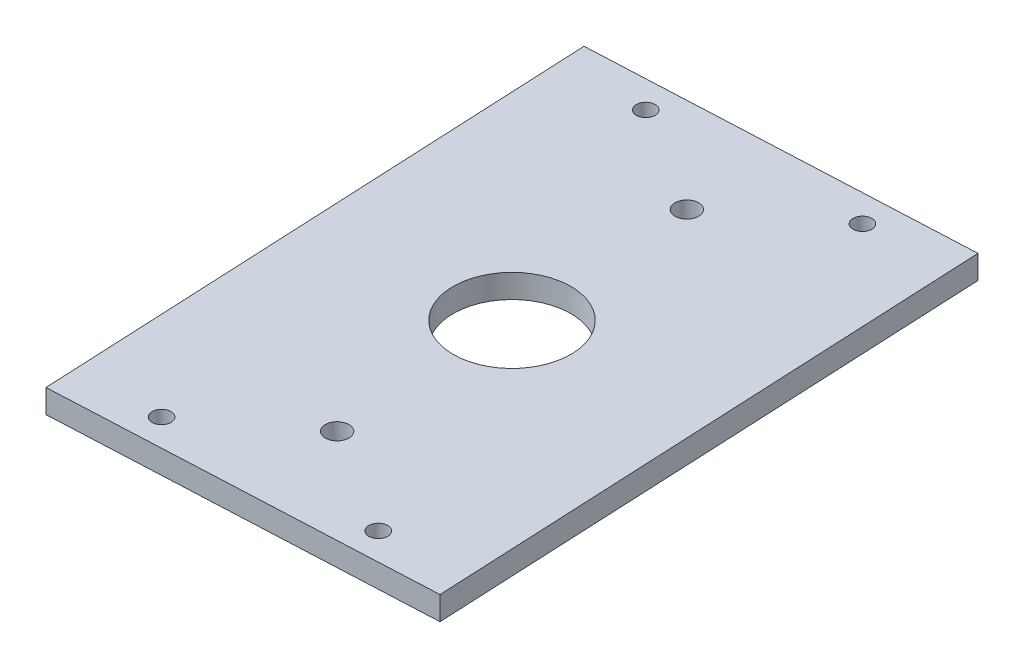
ISO-10303-21;
HEADER;
FILE_DESCRIPTION(('STEP AP214'),'2;1');
FILE_NAME('part.step','',(''),(''),'','','');
FILE_SCHEMA(('AUTOMOTIVE_DESIGN { 1 0 10303 214 1 1 1 1 }'));
ENDSEC;
DATA;
#1=APPLICATION_CONTEXT('core data for automotive mechanical design processes');
#2=APPLICATION_PROTOCOL_DEFINITION('international standard','automotive_design',2000,#1);
#3=PRODUCT_CONTEXT('',#1,'mechanical');
#4=PRODUCT('Part','Part','',(#3));
#5=PRODUCT_RELATED_PRODUCT_CATEGORY('part','',(#4));
#6=PRODUCT_DEFINITION_FORMATION('','',#4);
#7=PRODUCT_DEFINITION_CONTEXT('part definition',#1,'design');
#8=PRODUCT_DEFINITION('design','',#6,#7);
#9=PRODUCT_DEFINITION_SHAPE('','',#8);
#10=(LENGTH_UNIT() NAMED_UNIT(*) SI_UNIT(.MILLI.,.METRE.));
#11=(NAMED_UNIT(*) PLANE_ANGLE_UNIT() SI_UNIT($,.RADIAN.));
#12=(NAMED_UNIT(*) SI_UNIT($,.STERADIAN.) SOLID_ANGLE_UNIT());
#13=UNCERTAINTY_MEASURE_WITH_UNIT(LENGTH_MEASURE(1.E-05),#10,'distance_accuracy_value','');
#14=(GEOMETRIC_REPRESENTATION_CONTEXT(3) GLOBAL_UNCERTAINTY_ASSIGNED_CONTEXT((#13)) GLOBAL_UNIT_ASSIGNED_CONTEXT((#10,
#11,#12)) REPRESENTATION_CONTEXT('',''));
#15=CARTESIAN_POINT('',(0.,0.,0.));
#16=DIRECTION('',(0.,0.,1.));
#17=DIRECTION('',(1.,0.,0.));
#18=AXIS2_PLACEMENT_3D('',#15,#16,#17);
#19=CARTESIAN_POINT('',(0.,5.00000000000006,0.));
#20=DIRECTION('',(0.,1.,0.));
#21=DIRECTION('',(0.,0.,1.));
#22=AXIS2_PLACEMENT_3D('',#19,#20,#21);
#23=PLANE('',#22);
#24=CARTESIAN_POINT('',(-1.82862353028719,5.00000000000006,-38.957106360515));
#25=DIRECTION('',(0.,1.,0.));
#26=DIRECTION('',(0.,0.,1.));
#27=AXIS2_PLACEMENT_3D('',#24,#25,#26);
#28=CIRCLE('',#27,2.50000000000001);
#29=CARTESIAN_POINT('',(-1.82862353028719,5.00000000000006,-36.457106360515));
#30=VERTEX_POINT('',#29);
#31=EDGE_CURVE('E140',#30,#30,#28,.T.);
#32=ORIENTED_EDGE('',*,*,#31,.F.);
#33=EDGE_LOOP('',(#32));
#34=FACE_BOUND('',#33,.T.);
#35=CARTESIAN_POINT('',(-19.4438633152775,5.00000000000006,54.9721400290802));
#36=DIRECTION('',(0.,1.,0.));
#37=DIRECTION('',(0.,0.,-1.));
#38=AXIS2_PLACEMENT_3D('',#35,#36,#37);
#39=CIRCLE('',#38,1.99999999999996);
#40=CARTESIAN_POINT('',(-19.4438633152775,5.00000000000006,52.9721400290803));
#41=VERTEX_POINT('',#40);
#42=EDGE_CURVE('E128',#41,#41,#39,.T.);
#43=ORIENTED_EDGE('',*,*,#42,.F.);
#44=EDGE_LOOP('',(#43));
#45=FACE_BOUND('',#44,.T.);
#46=CARTESIAN_POINT('',(24.5077438606882,5.00000000000006,52.9090775846537));
#47=DIRECTION('',(0.,1.,0.));
#48=DIRECTION('',(0.,0.,1.));
#49=AXIS2_PLACEMENT_3D('',#46,#47,#48);
#50=CIRCLE('',#49,1.99999999999999);
#51=CARTESIAN_POINT('',(24.5077438606882,5.00000000000006,54.9090775846537));
#52=VERTEX_POINT('',#51);
#53=EDGE_CURVE('E116',#52,#52,#50,.T.);
#54=ORIENTED_EDGE('',*,*,#53,.F.);
#55=EDGE_LOOP('',(#54));
#56=FACE_BOUND('',#55,.T.);
#57=DIRECTION('',(0.998900163090129,0.,-0.0468877828278765));
#58=VECTOR('',#57,1.);
#59=CARTESIAN_POINT('',(-37.1427395539326,5.00000000000006,61.8095210985228));
#60=LINE('',#59,#58);
#61=CARTESIAN_POINT('',(-37.1427395539326,5.00000000000006,61.8095210985228));
#62=VERTEX_POINT('',#61);
#63=CARTESIAN_POINT('',(42.7692734932777,5.00000000000006,58.0584984722927));
#64=VERTEX_POINT('',#63);
#65=EDGE_CURVE('E86',#62,#64,#60,.T.);
#66=ORIENTED_EDGE('',*,*,#65,.T.);
#67=DIRECTION('',(-0.0468877828278762,0.,-0.998900163090129));
#68=VECTOR('',#67,1.);
#69=CARTESIAN_POINT('',(42.7692734932777,5.00000000000006,58.0584984722927));
#70=LINE('',#69,#68);
#71=CARTESIAN_POINT('',(37.1427395539326,5.00000000000006,-61.8095210985228));
#72=VERTEX_POINT('',#71);
#73=EDGE_CURVE('E81',#64,#72,#70,.T.);
#74=ORIENTED_EDGE('',*,*,#73,.T.);
#75=DIRECTION('',(-0.998900163090129,0.,0.0468877828278757));
#76=VECTOR('',#75,1.);
#77=CARTESIAN_POINT('',(37.1427395539326,5.00000000000006,-61.8095210985228));
#78=LINE('',#77,#76);
#79=CARTESIAN_POINT('',(-42.7692734932778,5.00000000000006,-58.0584984722927));
#80=VERTEX_POINT('',#79);
#81=EDGE_CURVE('E84',#72,#80,#78,.T.);
#82=ORIENTED_EDGE('',*,*,#81,.T.);
#83=DIRECTION('',(0.0468877828278767,0.,0.998900163090129));
#84=VECTOR('',#83,1.);
#85=CARTESIAN_POINT('',(-42.7692734932778,5.00000000000006,-58.0584984722927));
#86=LINE('',#85,#84);
#87=EDGE_CURVE('E51',#80,#62,#86,.T.);
#88=ORIENTED_EDGE('',*,*,#87,.T.);
#89=EDGE_LOOP('',(#66,#74,#82,#88));
#90=FACE_BOUND('',#89,.T.);
#91=CARTESIAN_POINT('',(19.4438633152775,5.00000000000006,-54.9721400290802));
#92=DIRECTION('',(0.,1.,0.));
#93=DIRECTION('',(0.,0.,-1.));
#94=AXIS2_PLACEMENT_3D('',#91,#92,#93);
#95=CIRCLE('',#94,2.00000000000001);
#96=CARTESIAN_POINT('',(19.4438633152775,5.00000000000006,-56.9721400290803));
#97=VERTEX_POINT('',#96);
#98=EDGE_CURVE('E101',#97,#97,#95,.T.);
#99=ORIENTED_EDGE('',*,*,#98,.F.);
#100=EDGE_LOOP('',(#99));
#101=FACE_BOUND('',#100,.T.);
#102=CARTESIAN_POINT('',(-24.5077438606882,5.00000000000006,-52.9090775846536));
#103=DIRECTION('',(0.,1.,0.));
#104=DIRECTION('',(0.,0.,1.));
#105=AXIS2_PLACEMENT_3D('',#102,#103,#104);
#106=CIRCLE('',#105,2.00000000000001);
#107=CARTESIAN_POINT('',(-24.5077438606882,5.00000000000006,-50.9090775846536));
#108=VERTEX_POINT('',#107);
#109=EDGE_CURVE('E122',#108,#108,#106,.T.);
#110=ORIENTED_EDGE('',*,*,#109,.F.);
#111=EDGE_LOOP('',(#110));
#112=FACE_BOUND('',#111,.T.);
#113=CARTESIAN_POINT('',(0.,5.00000000000006,0.));
#114=DIRECTION('',(0.,1.,0.));
#115=DIRECTION('',(0.,0.,1.));
#116=AXIS2_PLACEMENT_3D('',#113,#114,#115);
#117=CIRCLE('',#116,12.5);
#118=CARTESIAN_POINT('',(0.,5.00000000000006,12.5));
#119=VERTEX_POINT('',#118);
#120=EDGE_CURVE('E134',#119,#119,#117,.T.);
#121=ORIENTED_EDGE('',*,*,#120,.F.);
#122=EDGE_LOOP('',(#121));
#123=FACE_BOUND('',#122,.T.);
#124=CARTESIAN_POINT('',(1.82862353028719,5.00000000000006,38.957106360515));
#125=DIRECTION('',(0.,1.,0.));
#126=DIRECTION('',(0.,0.,-1.));
#127=AXIS2_PLACEMENT_3D('',#124,#125,#126);
#128=CIRCLE('',#127,2.50000000000001);
#129=CARTESIAN_POINT('',(1.82862353028719,5.00000000000006,36.457106360515));
#130=VERTEX_POINT('',#129);
#131=EDGE_CURVE('E146',#130,#130,#128,.T.);
#132=ORIENTED_EDGE('',*,*,#131,.F.);
#133=EDGE_LOOP('',(#132));
#134=FACE_BOUND('',#133,.T.);
#135=ADVANCED_FACE('F34',(#34,#45,#56,#90,#101,#112,#123,#134),#23,.T.);
#136=CARTESIAN_POINT('',(0.,0.,0.));
#137=DIRECTION('',(0.,1.,0.));
#138=DIRECTION('',(0.,0.,1.));
#139=AXIS2_PLACEMENT_3D('',#136,#137,#138);
#140=PLANE('',#139);
#141=DIRECTION('',(0.998900163090129,0.,-0.0468877828278765));
#142=VECTOR('',#141,1.);
#143=CARTESIAN_POINT('',(-37.1427395539326,0.,61.8095210985228));
#144=LINE('',#143,#142);
#145=CARTESIAN_POINT('',(-37.1427395539326,0.,61.8095210985228));
#146=VERTEX_POINT('',#145);
#147=CARTESIAN_POINT('',(42.7692734932777,0.,58.0584984722927));
#148=VERTEX_POINT('',#147);
#149=EDGE_CURVE('E98',#146,#148,#144,.T.);
#150=ORIENTED_EDGE('',*,*,#149,.F.);
#151=DIRECTION('',(0.0468877828278767,0.,0.998900163090129));
#152=VECTOR('',#151,1.);
#153=CARTESIAN_POINT('',(-42.7692734932778,0.,-58.0584984722927));
#154=LINE('',#153,#152);
#155=CARTESIAN_POINT('',(-42.7692734932778,0.,-58.0584984722927));
#156=VERTEX_POINT('',#155);
#157=EDGE_CURVE('E74',#156,#146,#154,.T.);
#158=ORIENTED_EDGE('',*,*,#157,.F.);
#159=DIRECTION('',(-0.998900163090129,0.,0.0468877828278757));
#160=VECTOR('',#159,1.);
#161=CARTESIAN_POINT('',(37.1427395539326,0.,-61.8095210985228));
#162=LINE('',#161,#160);
#163=CARTESIAN_POINT('',(37.1427395539326,0.,-61.8095210985228));
#164=VERTEX_POINT('',#163);
#165=EDGE_CURVE('E68',#164,#156,#162,.T.);
#166=ORIENTED_EDGE('',*,*,#165,.F.);
#167=DIRECTION('',(-0.0468877828278762,0.,-0.998900163090129));
#168=VECTOR('',#167,1.);
#169=CARTESIAN_POINT('',(42.7692734932777,0.,58.0584984722927));
#170=LINE('',#169,#168);
#171=EDGE_CURVE('E90',#148,#164,#170,.T.);
#172=ORIENTED_EDGE('',*,*,#171,.F.);
#173=EDGE_LOOP('',(#150,#158,#166,#172));
#174=FACE_BOUND('',#173,.T.);
#175=CARTESIAN_POINT('',(19.4438633152775,0.,-54.9721400290802));
#176=DIRECTION('',(0.,1.,0.));
#177=DIRECTION('',(0.,0.,-1.));
#178=AXIS2_PLACEMENT_3D('',#175,#176,#177);
#179=CIRCLE('',#178,2.00000000000001);
#180=CARTESIAN_POINT('',(19.4438633152775,0.,-56.9721400290803));
#181=VERTEX_POINT('',#180);
#182=EDGE_CURVE('E113',#181,#181,#179,.T.);
#183=ORIENTED_EDGE('',*,*,#182,.T.);
#184=EDGE_LOOP('',(#183));
#185=FACE_BOUND('',#184,.T.);
#186=CARTESIAN_POINT('',(24.5077438606882,0.,52.9090775846537));
#187=DIRECTION('',(0.,1.,0.));
#188=DIRECTION('',(0.,0.,1.));
#189=AXIS2_PLACEMENT_3D('',#186,#187,#188);
#190=CIRCLE('',#189,1.99999999999999);
#191=CARTESIAN_POINT('',(24.5077438606882,0.,54.9090775846537));
#192=VERTEX_POINT('',#191);
#193=EDGE_CURVE('E119',#192,#192,#190,.T.);
#194=ORIENTED_EDGE('',*,*,#193,.T.);
#195=EDGE_LOOP('',(#194));
#196=FACE_BOUND('',#195,.T.);
#197=CARTESIAN_POINT('',(-24.5077438606882,0.,-52.9090775846536));
#198=DIRECTION('',(0.,1.,0.));
#199=DIRECTION('',(0.,0.,1.));
#200=AXIS2_PLACEMENT_3D('',#197,#198,#199);
#201=CIRCLE('',#200,2.00000000000001);
#202=CARTESIAN_POINT('',(-24.5077438606882,0.,-50.9090775846536));
#203=VERTEX_POINT('',#202);
#204=EDGE_CURVE('E125',#203,#203,#201,.T.);
#205=ORIENTED_EDGE('',*,*,#204,.T.);
#206=EDGE_LOOP('',(#205));
#207=FACE_BOUND('',#206,.T.);
#208=CARTESIAN_POINT('',(-19.4438633152775,0.,54.9721400290802));
#209=DIRECTION('',(0.,1.,0.));
#210=DIRECTION('',(0.,0.,-1.));
#211=AXIS2_PLACEMENT_3D('',#208,#209,#210);
#212=CIRCLE('',#211,1.99999999999996);
#213=CARTESIAN_POINT('',(-19.4438633152775,0.,52.9721400290803));
#214=VERTEX_POINT('',#213);
#215=EDGE_CURVE('E131',#214,#214,#212,.T.);
#216=ORIENTED_EDGE('',*,*,#215,.T.);
#217=EDGE_LOOP('',(#216));
#218=FACE_BOUND('',#217,.T.);
#219=CARTESIAN_POINT('',(0.,0.,0.));
#220=DIRECTION('',(0.,1.,0.));
#221=DIRECTION('',(0.,0.,1.));
#222=AXIS2_PLACEMENT_3D('',#219,#220,#221);
#223=CIRCLE('',#222,12.5);
#224=CARTESIAN_POINT('',(0.,0.,12.5));
#225=VERTEX_POINT('',#224);
#226=EDGE_CURVE('E137',#225,#225,#223,.T.);
#227=ORIENTED_EDGE('',*,*,#226,.T.);
#228=EDGE_LOOP('',(#227));
#229=FACE_BOUND('',#228,.T.);
#230=CARTESIAN_POINT('',(-1.82862353028719,0.,-38.957106360515));
#231=DIRECTION('',(0.,1.,0.));
#232=DIRECTION('',(0.,0.,1.));
#233=AXIS2_PLACEMENT_3D('',#230,#231,#232);
#234=CIRCLE('',#233,2.50000000000001);
#235=CARTESIAN_POINT('',(-1.82862353028719,0.,-36.457106360515));
#236=VERTEX_POINT('',#235);
#237=EDGE_CURVE('E143',#236,#236,#234,.T.);
#238=ORIENTED_EDGE('',*,*,#237,.T.);
#239=EDGE_LOOP('',(#238));
#240=FACE_BOUND('',#239,.T.);
#241=CARTESIAN_POINT('',(1.82862353028719,0.,38.957106360515));
#242=DIRECTION('',(0.,1.,0.));
#243=DIRECTION('',(0.,0.,-1.));
#244=AXIS2_PLACEMENT_3D('',#241,#242,#243);
#245=CIRCLE('',#244,2.50000000000001);
#246=CARTESIAN_POINT('',(1.82862353028719,0.,36.457106360515));
#247=VERTEX_POINT('',#246);
#248=EDGE_CURVE('E149',#247,#247,#245,.T.);
#249=ORIENTED_EDGE('',*,*,#248,.T.);
#250=EDGE_LOOP('',(#249));
#251=FACE_BOUND('',#250,.T.);
#252=ADVANCED_FACE('F109',(#174,#185,#196,#207,#218,#229,#240,#251),#140,.F.);
#253=CARTESIAN_POINT('',(-37.1427395539326,5.00000000000006,61.8095210985228));
#254=DIRECTION('',(-0.0468877828278765,0.,-0.998900163090129));
#255=DIRECTION('',(-0.998900163090129,0.,0.0468877828278765));
#256=AXIS2_PLACEMENT_3D('',#253,#254,#255);
#257=PLANE('',#256);
#258=ORIENTED_EDGE('',*,*,#149,.T.);
#259=DIRECTION('',(0.,-1.,0.));
#260=VECTOR('',#259,1.);
#261=CARTESIAN_POINT('',(42.7692734932777,5.00000000000006,58.0584984722927));
#262=LINE('',#261,#260);
#263=EDGE_CURVE('E11',#64,#148,#262,.T.);
#264=ORIENTED_EDGE('',*,*,#263,.F.);
#265=ORIENTED_EDGE('',*,*,#65,.F.);
#266=DIRECTION('',(0.,-1.,0.));
#267=VECTOR('',#266,1.);
#268=CARTESIAN_POINT('',(-37.1427395539326,5.00000000000006,61.8095210985228));
#269=LINE('',#268,#267);
#270=EDGE_CURVE('E94',#62,#146,#269,.T.);
#271=ORIENTED_EDGE('',*,*,#270,.T.);
#272=EDGE_LOOP('',(#258,#264,#265,#271));
#273=FACE_BOUND('',#272,.T.);
#274=ADVANCED_FACE('F36',(#273),#257,.F.);
#275=CARTESIAN_POINT('',(42.7692734932777,5.00000000000006,58.0584984722927));
#276=DIRECTION('',(-0.998900163090129,0.,0.0468877828278762));
#277=DIRECTION('',(0.0468877828278762,0.,0.998900163090129));
#278=AXIS2_PLACEMENT_3D('',#275,#276,#277);
#279=PLANE('',#278);
#280=ORIENTED_EDGE('',*,*,#171,.T.);
#281=DIRECTION('',(0.,-1.,0.));
#282=VECTOR('',#281,1.);
#283=CARTESIAN_POINT('',(37.1427395539326,5.00000000000006,-61.8095210985228));
#284=LINE('',#283,#282);
#285=EDGE_CURVE('E43',#72,#164,#284,.T.);
#286=ORIENTED_EDGE('',*,*,#285,.F.);
#287=ORIENTED_EDGE('',*,*,#73,.F.);
#288=ORIENTED_EDGE('',*,*,#263,.T.);
#289=EDGE_LOOP('',(#280,#286,#287,#288));
#290=FACE_BOUND('',#289,.T.);
#291=ADVANCED_FACE('F89',(#290),#279,.F.);
#292=CARTESIAN_POINT('',(37.1427395539326,5.00000000000006,-61.8095210985228));
#293=DIRECTION('',(0.0468877828278757,0.,0.998900163090129));
#294=DIRECTION('',(0.998900163090129,0.,-0.0468877828278757));
#295=AXIS2_PLACEMENT_3D('',#292,#293,#294);
#296=PLANE('',#295);
#297=ORIENTED_EDGE('',*,*,#165,.T.);
#298=DIRECTION('',(0.,-1.,0.));
#299=VECTOR('',#298,1.);
#300=CARTESIAN_POINT('',(-42.7692734932778,5.00000000000006,-58.0584984722927));
#301=LINE('',#300,#299);
#302=EDGE_CURVE('E91',#80,#156,#301,.T.);
#303=ORIENTED_EDGE('',*,*,#302,.F.);
#304=ORIENTED_EDGE('',*,*,#81,.F.);
#305=ORIENTED_EDGE('',*,*,#285,.T.);
#306=EDGE_LOOP('',(#297,#303,#304,#305));
#307=FACE_BOUND('',#306,.T.);
#308=ADVANCED_FACE('F92',(#307),#296,.F.);
#309=CARTESIAN_POINT('',(-42.7692734932778,5.00000000000006,-58.0584984722927));
#310=DIRECTION('',(0.998900163090129,0.,-0.0468877828278767));
#311=DIRECTION('',(-0.0468877828278767,0.,-0.998900163090129));
#312=AXIS2_PLACEMENT_3D('',#309,#310,#311);
#313=PLANE('',#312);
#314=ORIENTED_EDGE('',*,*,#157,.T.);
#315=ORIENTED_EDGE('',*,*,#270,.F.);
#316=ORIENTED_EDGE('',*,*,#87,.F.);
#317=ORIENTED_EDGE('',*,*,#302,.T.);
#318=EDGE_LOOP('',(#314,#315,#316,#317));
#319=FACE_BOUND('',#318,.T.);
#320=ADVANCED_FACE('F106',(#319),#313,.F.);
#321=CARTESIAN_POINT('',(19.4438633152775,5.00000000000006,-54.9721400290802));
#322=DIRECTION('',(0.,-1.,0.));
#323=DIRECTION('',(0.,0.,-1.));
#324=AXIS2_PLACEMENT_3D('',#321,#322,#323);
#325=CYLINDRICAL_SURFACE('',#324,2.00000000000001);
#326=ORIENTED_EDGE('',*,*,#98,.T.);
#327=EDGE_LOOP('',(#326));
#328=FACE_BOUND('',#327,.T.);
#329=ORIENTED_EDGE('',*,*,#182,.F.);
#330=EDGE_LOOP('',(#329));
#331=FACE_BOUND('',#330,.T.);
#332=ADVANCED_FACE('F168',(#328,#331),#325,.F.);
#333=CARTESIAN_POINT('',(24.5077438606882,5.00000000000006,52.9090775846537));
#334=DIRECTION('',(0.,-1.,0.));
#335=DIRECTION('',(0.,0.,-1.));
#336=AXIS2_PLACEMENT_3D('',#333,#334,#335);
#337=CYLINDRICAL_SURFACE('',#336,1.99999999999999);
#338=ORIENTED_EDGE('',*,*,#53,.T.);
#339=EDGE_LOOP('',(#338));
#340=FACE_BOUND('',#339,.T.);
#341=ORIENTED_EDGE('',*,*,#193,.F.);
#342=EDGE_LOOP('',(#341));
#343=FACE_BOUND('',#342,.T.);
#344=ADVANCED_FACE('F214',(#340,#343),#337,.F.);
#345=CARTESIAN_POINT('',(-24.5077438606882,5.00000000000006,-52.9090775846536));
#346=DIRECTION('',(0.,-1.,0.));
#347=DIRECTION('',(0.,0.,-1.));
#348=AXIS2_PLACEMENT_3D('',#345,#346,#347);
#349=CYLINDRICAL_SURFACE('',#348,2.00000000000001);
#350=ORIENTED_EDGE('',*,*,#109,.T.);
#351=EDGE_LOOP('',(#350));
#352=FACE_BOUND('',#351,.T.);
#353=ORIENTED_EDGE('',*,*,#204,.F.);
#354=EDGE_LOOP('',(#353));
#355=FACE_BOUND('',#354,.T.);
#356=ADVANCED_FACE('F222',(#352,#355),#349,.F.);
#357=CARTESIAN_POINT('',(-19.4438633152775,5.00000000000006,54.9721400290802));
#358=DIRECTION('',(0.,-1.,0.));
#359=DIRECTION('',(0.,0.,-1.));
#360=AXIS2_PLACEMENT_3D('',#357,#358,#359);
#361=CYLINDRICAL_SURFACE('',#360,1.99999999999996);
#362=ORIENTED_EDGE('',*,*,#42,.T.);
#363=EDGE_LOOP('',(#362));
#364=FACE_BOUND('',#363,.T.);
#365=ORIENTED_EDGE('',*,*,#215,.F.);
#366=EDGE_LOOP('',(#365));
#367=FACE_BOUND('',#366,.T.);
#368=ADVANCED_FACE('F230',(#364,#367),#361,.F.);
#369=CARTESIAN_POINT('',(0.,5.00000000000006,0.));
#370=DIRECTION('',(0.,-1.,0.));
#371=DIRECTION('',(0.,0.,-1.));
#372=AXIS2_PLACEMENT_3D('',#369,#370,#371);
#373=CYLINDRICAL_SURFACE('',#372,12.5);
#374=ORIENTED_EDGE('',*,*,#120,.T.);
#375=EDGE_LOOP('',(#374));
#376=FACE_BOUND('',#375,.T.);
#377=ORIENTED_EDGE('',*,*,#226,.F.);
#378=EDGE_LOOP('',(#377));
#379=FACE_BOUND('',#378,.T.);
#380=ADVANCED_FACE('F239',(#376,#379),#373,.F.);
#381=CARTESIAN_POINT('',(-1.82862353028719,5.00000000000006,-38.957106360515));
#382=DIRECTION('',(0.,-1.,0.));
#383=DIRECTION('',(0.,0.,-1.));
#384=AXIS2_PLACEMENT_3D('',#381,#382,#383);
#385=CYLINDRICAL_SURFACE('',#384,2.50000000000001);
#386=ORIENTED_EDGE('',*,*,#31,.T.);
#387=EDGE_LOOP('',(#386));
#388=FACE_BOUND('',#387,.T.);
#389=ORIENTED_EDGE('',*,*,#237,.F.);
#390=EDGE_LOOP('',(#389));
#391=FACE_BOUND('',#390,.T.);
#392=ADVANCED_FACE('F248',(#388,#391),#385,.F.);
#393=CARTESIAN_POINT('',(1.82862353028719,5.00000000000006,38.957106360515));
#394=DIRECTION('',(0.,-1.,0.));
#395=DIRECTION('',(0.,0.,-1.));
#396=AXIS2_PLACEMENT_3D('',#393,#394,#395);
#397=CYLINDRICAL_SURFACE('',#396,2.50000000000001);
#398=ORIENTED_EDGE('',*,*,#131,.T.);
#399=EDGE_LOOP('',(#398));
#400=FACE_BOUND('',#399,.T.);
#401=ORIENTED_EDGE('',*,*,#248,.F.);
#402=EDGE_LOOP('',(#401));
#403=FACE_BOUND('',#402,.T.);
#404=ADVANCED_FACE('F155',(#400,#403),#397,.F.);
#405=CLOSED_SHELL('',(#135,#252,#274,#291,#308,#320,#332,#344,#356,#368,#380,#392,#404));
#406=MANIFOLD_SOLID_BREP('B2',#405);
#407=ADVANCED_BREP_SHAPE_REPRESENTATION('',(#18,#406),#14);
#408=SHAPE_DEFINITION_REPRESENTATION(#9,#407);
ENDSEC;
END-ISO-10303-21;
